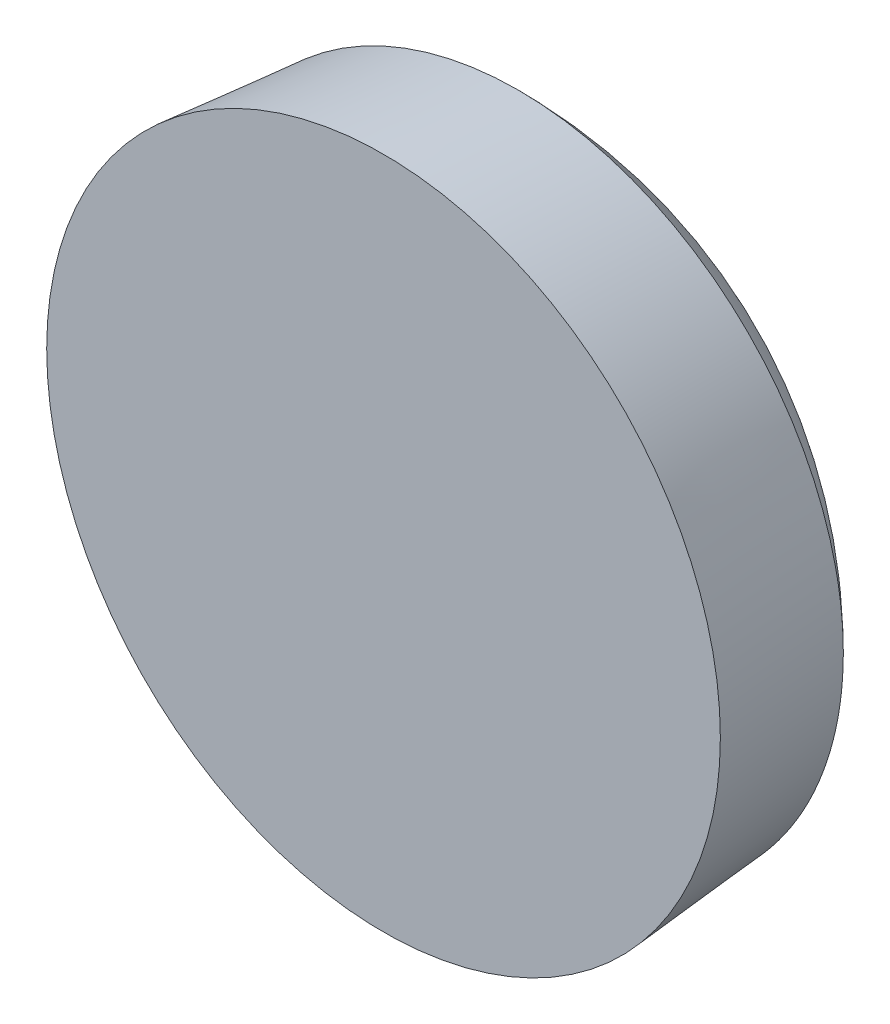
ISO-10303-21;
HEADER;
FILE_DESCRIPTION(('STEP AP214'),'2;1');
FILE_NAME('part.step','',(''),(''),'','','');
FILE_SCHEMA(('AUTOMOTIVE_DESIGN { 1 0 10303 214 1 1 1 1 }'));
ENDSEC;
DATA;
#1=APPLICATION_CONTEXT('core data for automotive mechanical design processes');
#2=APPLICATION_PROTOCOL_DEFINITION('international standard','automotive_design',2000,#1);
#3=PRODUCT_CONTEXT('',#1,'mechanical');
#4=PRODUCT('Part','Part','',(#3));
#5=PRODUCT_RELATED_PRODUCT_CATEGORY('part','',(#4));
#6=PRODUCT_DEFINITION_FORMATION('','',#4);
#7=PRODUCT_DEFINITION_CONTEXT('part definition',#1,'design');
#8=PRODUCT_DEFINITION('design','',#6,#7);
#9=PRODUCT_DEFINITION_SHAPE('','',#8);
#10=(LENGTH_UNIT() NAMED_UNIT(*) SI_UNIT(.MILLI.,.METRE.));
#11=(NAMED_UNIT(*) PLANE_ANGLE_UNIT() SI_UNIT($,.RADIAN.));
#12=(NAMED_UNIT(*) SI_UNIT($,.STERADIAN.) SOLID_ANGLE_UNIT());
#13=UNCERTAINTY_MEASURE_WITH_UNIT(LENGTH_MEASURE(1.E-05),#10,'distance_accuracy_value','');
#14=(GEOMETRIC_REPRESENTATION_CONTEXT(3) GLOBAL_UNCERTAINTY_ASSIGNED_CONTEXT((#13)) GLOBAL_UNIT_ASSIGNED_CONTEXT((#10,
#11,#12)) REPRESENTATION_CONTEXT('',''));
#15=CARTESIAN_POINT('',(0.,0.,0.));
#16=DIRECTION('',(0.,0.,1.));
#17=DIRECTION('',(1.,0.,0.));
#18=AXIS2_PLACEMENT_3D('',#15,#16,#17);
#19=CARTESIAN_POINT('',(6.90000000000015,4.50499199787339,-21.6));
#20=DIRECTION('',(0.,0.,-1.));
#21=DIRECTION('',(0.,1.,0.));
#22=AXIS2_PLACEMENT_3D('',#19,#20,#21);
#23=PLANE('',#22);
#24=DIRECTION('',(0.747876143588401,-0.66383828893138,0.));
#25=VECTOR('',#24,1.);
#26=CARTESIAN_POINT('',(7.0194908920078,4.6396097037193,-21.6));
#27=LINE('',#26,#25);
#28=CARTESIAN_POINT('',(6.88487318616189,4.75910059572695,-21.6));
#29=VERTEX_POINT('',#28);
#30=CARTESIAN_POINT('',(6.30900855559882,5.27025607820411,-21.6));
#31=VERTEX_POINT('',#30);
#32=EDGE_CURVE('E84',#29,#31,#27,.F.);
#33=ORIENTED_EDGE('',*,*,#32,.F.);
#34=DIRECTION('',(0.66383828893138,0.747876143588401,0.));
#35=VECTOR('',#34,1.);
#36=CARTESIAN_POINT('',(6.76538229415424,4.62448288988104,-21.6));
#37=LINE('',#36,#35);
#38=CARTESIAN_POINT('',(7.39602866863905,5.33496522629002,-21.6));
#39=VERTEX_POINT('',#38);
#40=EDGE_CURVE('E89',#39,#29,#37,.F.);
#41=ORIENTED_EDGE('',*,*,#40,.F.);
#42=DIRECTION('',(0.747876143588401,-0.66383828893138,0.));
#43=VECTOR('',#42,1.);
#44=CARTESIAN_POINT('',(7.53064637448496,5.21547433428237,-21.6));
#45=LINE('',#44,#43);
#46=CARTESIAN_POINT('',(7.66526408033088,5.09598344227472,-21.6));
#47=VERTEX_POINT('',#46);
#48=EDGE_CURVE('E140',#47,#39,#45,.F.);
#49=ORIENTED_EDGE('',*,*,#48,.F.);
#50=DIRECTION('',(-0.66383828893138,-0.747876143588401,0.));
#51=VECTOR('',#50,1.);
#52=CARTESIAN_POINT('',(7.03461770584607,4.38550110586574,-21.6));
#53=LINE('',#52,#51);
#54=CARTESIAN_POINT('',(7.15410859785371,4.52011881171165,-21.6));
#55=VERTEX_POINT('',#54);
#56=EDGE_CURVE('E151',#55,#47,#53,.F.);
#57=ORIENTED_EDGE('',*,*,#56,.F.);
#58=DIRECTION('',(0.747876143588401,-0.66383828893138,0.));
#59=VECTOR('',#58,1.);
#60=CARTESIAN_POINT('',(7.0194908920078,4.6396097037193,-21.6));
#61=LINE('',#60,#59);
#62=CARTESIAN_POINT('',(7.72997322841678,4.0089633292345,-21.6));
#63=VERTEX_POINT('',#62);
#64=EDGE_CURVE('E154',#63,#55,#61,.F.);
#65=ORIENTED_EDGE('',*,*,#64,.F.);
#66=DIRECTION('',(-0.66383828893138,-0.747876143588401,0.));
#67=VECTOR('',#66,1.);
#68=CARTESIAN_POINT('',(7.61048233640913,3.87434562338858,-21.6));
#69=LINE('',#68,#67);
#70=CARTESIAN_POINT('',(7.49099144440148,3.73972791754266,-21.6));
#71=VERTEX_POINT('',#70);
#72=EDGE_CURVE('E162',#71,#63,#69,.F.);
#73=ORIENTED_EDGE('',*,*,#72,.F.);
#74=DIRECTION('',(-0.747876143588401,0.66383828893138,0.));
#75=VECTOR('',#74,1.);
#76=CARTESIAN_POINT('',(6.7805091079925,4.37037429202747,-21.6));
#77=LINE('',#76,#75);
#78=CARTESIAN_POINT('',(6.91512681383842,4.25088340001982,-21.6));
#79=VERTEX_POINT('',#78);
#80=EDGE_CURVE('E167',#79,#71,#77,.F.);
#81=ORIENTED_EDGE('',*,*,#80,.F.);
#82=DIRECTION('',(-0.66383828893138,-0.747876143588401,0.));
#83=VECTOR('',#82,1.);
#84=CARTESIAN_POINT('',(7.03461770584607,4.38550110586574,-21.6));
#85=LINE('',#84,#83);
#86=CARTESIAN_POINT('',(6.40397133136126,3.67501876945676,-21.6));
#87=VERTEX_POINT('',#86);
#88=EDGE_CURVE('E172',#87,#79,#85,.F.);
#89=ORIENTED_EDGE('',*,*,#88,.F.);
#90=DIRECTION('',(0.747876143588401,-0.66383828893138,0.));
#91=VECTOR('',#90,1.);
#92=CARTESIAN_POINT('',(6.26935362551534,3.79450966146441,-21.6));
#93=LINE('',#92,#91);
#94=CARTESIAN_POINT('',(6.13473591966943,3.91400055347206,-21.6));
#95=VERTEX_POINT('',#94);
#96=EDGE_CURVE('E178',#87,#95,#93,.F.);
#97=ORIENTED_EDGE('',*,*,#96,.T.);
#98=DIRECTION('',(0.66383828893138,0.747876143588401,0.));
#99=VECTOR('',#98,1.);
#100=CARTESIAN_POINT('',(6.76538229415424,4.62448288988104,-21.6));
#101=LINE('',#100,#99);
#102=CARTESIAN_POINT('',(6.64589140214659,4.48986518403512,-21.6));
#103=VERTEX_POINT('',#102);
#104=EDGE_CURVE('E183',#103,#95,#101,.F.);
#105=ORIENTED_EDGE('',*,*,#104,.F.);
#106=DIRECTION('',(-0.747876143588401,0.66383828893138,0.));
#107=VECTOR('',#106,1.);
#108=CARTESIAN_POINT('',(6.7805091079925,4.37037429202747,-21.6));
#109=LINE('',#108,#107);
#110=CARTESIAN_POINT('',(6.07002677158352,5.00102066651228,-21.6));
#111=VERTEX_POINT('',#110);
#112=EDGE_CURVE('E119',#111,#103,#109,.F.);
#113=ORIENTED_EDGE('',*,*,#112,.F.);
#114=DIRECTION('',(-0.66383828893138,-0.747876143588401,0.));
#115=VECTOR('',#114,1.);
#116=CARTESIAN_POINT('',(6.18951766359117,5.1356383723582,-21.6));
#117=LINE('',#116,#115);
#118=EDGE_CURVE('E117',#111,#31,#117,.F.);
#119=ORIENTED_EDGE('',*,*,#118,.T.);
#120=EDGE_LOOP('',(#33,#41,#49,#57,#65,#73,#81,#89,#97,#105,#113,#119));
#121=FACE_BOUND('',#120,.T.);
#122=ADVANCED_FACE('F17',(#121),#23,.T.);
#123=CARTESIAN_POINT('',(7.0194908920078,4.6396097037193,-22.2));
#124=DIRECTION('',(-0.66383828893138,-0.747876143588401,0.));
#125=DIRECTION('',(0.747876143588401,-0.66383828893138,0.));
#126=AXIS2_PLACEMENT_3D('',#123,#124,#125);
#127=PLANE('',#126);
#128=DIRECTION('',(0.,0.,1.));
#129=VECTOR('',#128,1.);
#130=CARTESIAN_POINT('',(6.88487318616189,4.75910059572695,-22.2));
#131=LINE('',#130,#129);
#132=CARTESIAN_POINT('',(6.88487318616188,4.75910059572695,-22.788097569794));
#133=VERTEX_POINT('',#132);
#134=EDGE_CURVE('E127',#29,#133,#131,.F.);
#135=ORIENTED_EDGE('',*,*,#134,.F.);
#136=ORIENTED_EDGE('',*,*,#32,.T.);
#137=DIRECTION('',(0.,0.,1.));
#138=VECTOR('',#137,1.);
#139=CARTESIAN_POINT('',(6.30900855559882,5.27025607820411,-22.2));
#140=LINE('',#139,#138);
#141=CARTESIAN_POINT('',(6.30900855559882,5.27025607820411,-22.6229045231911));
#142=VERTEX_POINT('',#141);
#143=EDGE_CURVE('E123',#31,#142,#140,.F.);
#144=ORIENTED_EDGE('',*,*,#143,.T.);
#145=CARTESIAN_POINT('',(6.88487318616188,4.75910059572695,-22.788097569794));
#146=CARTESIAN_POINT('',(6.86018725238199,4.78101260372668,-22.7859104299673));
#147=CARTESIAN_POINT('',(6.83553118762501,4.80289809904617,-22.7831210421487));
#148=CARTESIAN_POINT('',(6.78640820570417,4.84650119635726,-22.7763560552392));
#149=CARTESIAN_POINT('',(6.76194092600565,4.868219120146,-22.7723851623111));
#150=CARTESIAN_POINT('',(6.71319426733734,4.91148818115152,-22.7632701136372));
#151=CARTESIAN_POINT('',(6.68891456403111,4.93303960625947,-22.7581290588921));
#152=CARTESIAN_POINT('',(6.64054218782471,4.97597644242906,-22.7466823115268));
#153=CARTESIAN_POINT('',(6.61644931068595,4.99736203477927,-22.7403781619621));
#154=CARTESIAN_POINT('',(6.56844981562365,5.03996788996653,-22.7266089835755));
#155=CARTESIAN_POINT('',(6.5445431977001,5.06118815280357,-22.7191439547536));
#156=CARTESIAN_POINT('',(6.4969160965814,5.10346345946291,-22.703052205587));
#157=CARTESIAN_POINT('',(6.47319590048995,5.12451824844295,-22.6944239659575));
#158=CARTESIAN_POINT('',(6.42594275839351,5.16646161736154,-22.6760004253173));
#159=CARTESIAN_POINT('',(6.40241046789993,5.18734961544761,-22.666202118307));
#160=CARTESIAN_POINT('',(6.35553505693748,5.22895769838091,-22.6454289197685));
#161=CARTESIAN_POINT('',(6.332193049565,5.24967679520893,-22.6344495373844));
#162=CARTESIAN_POINT('',(6.30900855559883,5.2702560782041,-22.6229045231911));
#163=B_SPLINE_CURVE_WITH_KNOTS('',3,(#145,#146,#147,#148,#149,#150,#151,#152,#153,#154,#155,
#156,#157,#158,#159,#160,#161,#162),.UNSPECIFIED.,.F.,.F.,(4,2,2,2,2,2,2,2,4),(0.,
0.0992357442434151,0.198081387639265,0.296668072480489,0.395124892694087,0.493581712907686,
0.59216839774891,0.69101404114476,0.790249785388174),.UNSPECIFIED.);
#164=EDGE_CURVE('E20',#133,#142,#163,.T.);
#165=ORIENTED_EDGE('',*,*,#164,.F.);
#166=EDGE_LOOP('',(#135,#136,#144,#165));
#167=FACE_BOUND('',#166,.T.);
#168=ADVANCED_FACE('F125',(#167),#127,.T.);
#169=CARTESIAN_POINT('',(6.18951766359117,5.1356383723582,-22.2));
#170=DIRECTION('',(-0.747876143588401,0.66383828893138,0.));
#171=DIRECTION('',(-0.66383828893138,-0.747876143588401,0.));
#172=AXIS2_PLACEMENT_3D('',#169,#170,#171);
#173=PLANE('',#172);
#174=ORIENTED_EDGE('',*,*,#118,.F.);
#175=DIRECTION('',(0.,0.,1.));
#176=VECTOR('',#175,1.);
#177=CARTESIAN_POINT('',(6.07002677158352,5.00102066651228,-22.2));
#178=LINE('',#177,#176);
#179=CARTESIAN_POINT('',(6.07002677158353,5.00102066651227,-22.6229045231911));
#180=VERTEX_POINT('',#179);
#181=EDGE_CURVE('E132',#180,#111,#178,.T.);
#182=ORIENTED_EDGE('',*,*,#181,.F.);
#183=CARTESIAN_POINT('',(6.30900855559881,5.27025607820411,-22.622904523191));
#184=CARTESIAN_POINT('',(6.26917825826292,5.22538350958884,-22.6271329188894));
#185=CARTESIAN_POINT('',(6.22934796092705,5.18051094097354,-22.6292471167385));
#186=CARTESIAN_POINT('',(6.14968736625534,5.09076580374292,-22.6292471167386));
#187=CARTESIAN_POINT('',(6.10985706891951,5.04589323512759,-22.6271329188894));
#188=CARTESIAN_POINT('',(6.0700267715837,5.00102066651224,-22.6229045231911));
#189=B_SPLINE_CURVE_WITH_KNOTS('',3,(#183,#184,#185,#186,#187,#188),.UNSPECIFIED.,.F.,.F.,(4,2,
4),(0.,0.180111711148645,0.360223422297292),.UNSPECIFIED.);
#190=EDGE_CURVE('E131',#142,#180,#189,.T.);
#191=ORIENTED_EDGE('',*,*,#190,.F.);
#192=ORIENTED_EDGE('',*,*,#143,.F.);
#193=EDGE_LOOP('',(#174,#182,#191,#192));
#194=FACE_BOUND('',#193,.T.);
#195=ADVANCED_FACE('F129',(#194),#173,.F.);
#196=CARTESIAN_POINT('',(6.7805091079925,4.37037429202747,-22.2));
#197=DIRECTION('',(0.66383828893138,0.747876143588401,0.));
#198=DIRECTION('',(-0.747876143588401,0.66383828893138,0.));
#199=AXIS2_PLACEMENT_3D('',#196,#197,#198);
#200=PLANE('',#199);
#201=DIRECTION('',(0.,0.,1.));
#202=VECTOR('',#201,1.);
#203=CARTESIAN_POINT('',(6.64589140214659,4.48986518403512,-22.2));
#204=LINE('',#203,#202);
#205=CARTESIAN_POINT('',(6.64589140214659,4.48986518403512,-22.788097569794));
#206=VERTEX_POINT('',#205);
#207=EDGE_CURVE('E180',#206,#103,#204,.T.);
#208=ORIENTED_EDGE('',*,*,#207,.F.);
#209=CARTESIAN_POINT('',(6.07002677158353,5.00102066651226,-22.6229045231911));
#210=CARTESIAN_POINT('',(6.0932112655497,4.98044138351709,-22.6344495373844));
#211=CARTESIAN_POINT('',(6.11655327292218,4.95972228668908,-22.6454289197685));
#212=CARTESIAN_POINT('',(6.16342868388463,4.91811420375577,-22.666202118307));
#213=CARTESIAN_POINT('',(6.18696097437821,4.89722620566971,-22.6760004253173));
#214=CARTESIAN_POINT('',(6.23421411647465,4.85528283675112,-22.6944239659575));
#215=CARTESIAN_POINT('',(6.2579343125661,4.83422804777108,-22.703052205587));
#216=CARTESIAN_POINT('',(6.30556141368481,4.79195274111174,-22.7191439547536));
#217=CARTESIAN_POINT('',(6.32946803160835,4.77073247827469,-22.7266089835755));
#218=CARTESIAN_POINT('',(6.37746752667065,4.72812662308744,-22.7403781619621));
#219=CARTESIAN_POINT('',(6.40156040380941,4.70674103073723,-22.7466823115268));
#220=CARTESIAN_POINT('',(6.44993278001582,4.66380419456763,-22.7581290588921));
#221=CARTESIAN_POINT('',(6.47421248332204,4.64225276945969,-22.7632701136372));
#222=CARTESIAN_POINT('',(6.52295914199035,4.59898370845417,-22.7723851623111));
#223=CARTESIAN_POINT('',(6.54742642168887,4.57726578466543,-22.7763560552392));
#224=CARTESIAN_POINT('',(6.59654940360971,4.53366268735433,-22.7831210421487));
#225=CARTESIAN_POINT('',(6.62120546836669,4.51177719203485,-22.7859104299673));
#226=CARTESIAN_POINT('',(6.64589140214659,4.48986518403512,-22.788097569794));
#227=B_SPLINE_CURVE_WITH_KNOTS('',3,(#209,#210,#211,#212,#213,#214,#215,#216,#217,#218,#219,
#220,#221,#222,#223,#224,#225,#226),.UNSPECIFIED.,.F.,.F.,(4,2,2,2,2,2,2,2,4),(0.,
0.0992357442434142,0.198081387639266,0.29666807248049,0.395124892694088,0.493581712907686,
0.592168397748911,0.69101404114476,0.790249785388176),.UNSPECIFIED.);
#228=EDGE_CURVE('E296',#180,#206,#227,.T.);
#229=ORIENTED_EDGE('',*,*,#228,.F.);
#230=ORIENTED_EDGE('',*,*,#181,.T.);
#231=ORIENTED_EDGE('',*,*,#112,.T.);
#232=EDGE_LOOP('',(#208,#229,#230,#231));
#233=FACE_BOUND('',#232,.T.);
#234=ADVANCED_FACE('F305',(#233),#200,.T.);
#235=CARTESIAN_POINT('',(6.76538229415424,4.62448288988104,-22.2));
#236=DIRECTION('',(0.747876143588401,-0.66383828893138,0.));
#237=DIRECTION('',(0.66383828893138,0.747876143588401,0.));
#238=AXIS2_PLACEMENT_3D('',#235,#236,#237);
#239=PLANE('',#238);
#240=CARTESIAN_POINT('',(6.64589140214659,4.48986518403512,-22.788097569794));
#241=CARTESIAN_POINT('',(6.62397939414685,4.46517925025523,-22.7859104299673));
#242=CARTESIAN_POINT('',(6.60209389882737,4.44052318549824,-22.7831210421487));
#243=CARTESIAN_POINT('',(6.55849080151627,4.39140020357741,-22.7763560552392));
#244=CARTESIAN_POINT('',(6.53677287772753,4.36693292387889,-22.7723851623111));
#245=CARTESIAN_POINT('',(6.49350381672202,4.31818626521058,-22.7632701136372));
#246=CARTESIAN_POINT('',(6.47195239161407,4.29390656190435,-22.7581290588921));
#247=CARTESIAN_POINT('',(6.42901555544448,4.24553418569795,-22.7466823115268));
#248=CARTESIAN_POINT('',(6.40762996309427,4.22144130855919,-22.7403781619621));
#249=CARTESIAN_POINT('',(6.36502410790701,4.17344181349689,-22.7266089835755));
#250=CARTESIAN_POINT('',(6.34380384506997,4.14953519557334,-22.7191439547536));
#251=CARTESIAN_POINT('',(6.30152853841063,4.10190809445464,-22.703052205587));
#252=CARTESIAN_POINT('',(6.28047374943058,4.07818789836319,-22.6944239659575));
#253=CARTESIAN_POINT('',(6.238530380512,4.03093475626675,-22.6760004253173));
#254=CARTESIAN_POINT('',(6.21764238242593,4.00740246577317,-22.666202118307));
#255=CARTESIAN_POINT('',(6.17603429949263,3.96052705481072,-22.6454289197685));
#256=CARTESIAN_POINT('',(6.15531520266461,3.93718504743825,-22.6344495373844));
#257=CARTESIAN_POINT('',(6.13473591966944,3.91400055347207,-22.6229045231911));
#258=B_SPLINE_CURVE_WITH_KNOTS('',3,(#240,#241,#242,#243,#244,#245,#246,#247,#248,#249,#250,
#251,#252,#253,#254,#255,#256,#257),.UNSPECIFIED.,.F.,.F.,(4,2,2,2,2,2,2,2,4),(0.,
0.0992357442434148,0.198081387639264,0.296668072480486,0.395124892694084,0.493581712907682,
0.592168397748906,0.691014041144754,0.790249785388168),.UNSPECIFIED.);
#259=CARTESIAN_POINT('',(6.13473591966943,3.91400055347206,-22.6229045231911));
#260=VERTEX_POINT('',#259);
#261=EDGE_CURVE('E289',#206,#260,#258,.T.);
#262=ORIENTED_EDGE('',*,*,#261,.F.);
#263=ORIENTED_EDGE('',*,*,#207,.T.);
#264=ORIENTED_EDGE('',*,*,#104,.T.);
#265=DIRECTION('',(0.,0.,1.));
#266=VECTOR('',#265,1.);
#267=CARTESIAN_POINT('',(6.13473591966943,3.91400055347206,-22.2));
#268=LINE('',#267,#266);
#269=EDGE_CURVE('E175',#95,#260,#268,.F.);
#270=ORIENTED_EDGE('',*,*,#269,.T.);
#271=EDGE_LOOP('',(#262,#263,#264,#270));
#272=FACE_BOUND('',#271,.T.);
#273=ADVANCED_FACE('F302',(#272),#239,.T.);
#274=CARTESIAN_POINT('',(6.26935362551534,3.79450966146441,-22.2));
#275=DIRECTION('',(-0.66383828893138,-0.747876143588401,0.));
#276=DIRECTION('',(0.747876143588401,-0.66383828893138,0.));
#277=AXIS2_PLACEMENT_3D('',#274,#275,#276);
#278=PLANE('',#277);
#279=ORIENTED_EDGE('',*,*,#96,.F.);
#280=DIRECTION('',(0.,0.,1.));
#281=VECTOR('',#280,1.);
#282=CARTESIAN_POINT('',(6.40397133136126,3.67501876945675,-22.2));
#283=LINE('',#282,#281);
#284=CARTESIAN_POINT('',(6.40397133136126,3.67501876945676,-22.6229045231911));
#285=VERTEX_POINT('',#284);
#286=EDGE_CURVE('E174',#285,#87,#283,.T.);
#287=ORIENTED_EDGE('',*,*,#286,.F.);
#288=CARTESIAN_POINT('',(6.13473591966943,3.91400055347206,-22.622904523191));
#289=CARTESIAN_POINT('',(6.17960848828474,3.87417025613617,-22.6271329188894));
#290=CARTESIAN_POINT('',(6.22448105690004,3.83433995880029,-22.6292471167385));
#291=CARTESIAN_POINT('',(6.31422619413064,3.75467936412853,-22.6292471167385));
#292=CARTESIAN_POINT('',(6.35909876274595,3.71484906679265,-22.6271329188894));
#293=CARTESIAN_POINT('',(6.40397133136125,3.67501876945676,-22.622904523191));
#294=B_SPLINE_CURVE_WITH_KNOTS('',3,(#288,#289,#290,#291,#292,#293),.UNSPECIFIED.,.F.,.F.,(4,2,
4),(0.,0.180111711148684,0.360223422297368),.UNSPECIFIED.);
#295=EDGE_CURVE('E282',#260,#285,#294,.T.);
#296=ORIENTED_EDGE('',*,*,#295,.F.);
#297=ORIENTED_EDGE('',*,*,#269,.F.);
#298=EDGE_LOOP('',(#279,#287,#296,#297));
#299=FACE_BOUND('',#298,.T.);
#300=ADVANCED_FACE('F271',(#299),#278,.F.);
#301=CARTESIAN_POINT('',(7.03461770584607,4.38550110586574,-22.2));
#302=DIRECTION('',(-0.747876143588401,0.66383828893138,0.));
#303=DIRECTION('',(-0.66383828893138,-0.747876143588401,0.));
#304=AXIS2_PLACEMENT_3D('',#301,#302,#303);
#305=PLANE('',#304);
#306=CARTESIAN_POINT('',(6.40397133136127,3.67501876945677,-22.622904523191));
#307=CARTESIAN_POINT('',(6.42455061435644,3.69820326342294,-22.6344495373844));
#308=CARTESIAN_POINT('',(6.44526971118445,3.72154527079542,-22.6454289197685));
#309=CARTESIAN_POINT('',(6.48687779411776,3.76842068175787,-22.666202118307));
#310=CARTESIAN_POINT('',(6.50776579220383,3.79195297225144,-22.6760004253173));
#311=CARTESIAN_POINT('',(6.54970916112241,3.83920611434789,-22.6944239659575));
#312=CARTESIAN_POINT('',(6.57076395010246,3.86292631043934,-22.703052205587));
#313=CARTESIAN_POINT('',(6.6130392567618,3.91055341155804,-22.7191439547536));
#314=CARTESIAN_POINT('',(6.63425951959884,3.93446002948158,-22.7266089835755));
#315=CARTESIAN_POINT('',(6.67686537478609,3.98245952454389,-22.7403781619621));
#316=CARTESIAN_POINT('',(6.6982509671363,4.00655240168265,-22.7466823115268));
#317=CARTESIAN_POINT('',(6.7411878033059,4.05492477788905,-22.7581290588921));
#318=CARTESIAN_POINT('',(6.76273922841385,4.07920448119528,-22.7632701136372));
#319=CARTESIAN_POINT('',(6.80600828941936,4.12795113986359,-22.7723851623111));
#320=CARTESIAN_POINT('',(6.8277262132081,4.15241841956211,-22.7763560552392));
#321=CARTESIAN_POINT('',(6.8713293105192,4.20154140148294,-22.7831210421487));
#322=CARTESIAN_POINT('',(6.89321480583868,4.22619746623993,-22.7859104299673));
#323=CARTESIAN_POINT('',(6.91512681383842,4.25088340001982,-22.788097569794));
#324=B_SPLINE_CURVE_WITH_KNOTS('',3,(#306,#307,#308,#309,#310,#311,#312,#313,#314,#315,#316,
#317,#318,#319,#320,#321,#322,#323),.UNSPECIFIED.,.F.,.F.,(4,2,2,2,2,2,2,2,4),(0.,
0.0992357442434163,0.198081387639265,0.29666807248049,0.395124892694089,0.493581712907688,
0.592168397748912,0.69101404114476,0.790249785388177),.UNSPECIFIED.);
#325=CARTESIAN_POINT('',(6.91512681383842,4.25088340001981,-22.788097569794));
#326=VERTEX_POINT('',#325);
#327=EDGE_CURVE('E275',#285,#326,#324,.T.);
#328=ORIENTED_EDGE('',*,*,#327,.F.);
#329=ORIENTED_EDGE('',*,*,#286,.T.);
#330=ORIENTED_EDGE('',*,*,#88,.T.);
#331=DIRECTION('',(0.,0.,1.));
#332=VECTOR('',#331,1.);
#333=CARTESIAN_POINT('',(6.91512681383842,4.25088340001982,-22.2));
#334=LINE('',#333,#332);
#335=EDGE_CURVE('E169',#326,#79,#334,.T.);
#336=ORIENTED_EDGE('',*,*,#335,.F.);
#337=EDGE_LOOP('',(#328,#329,#330,#336));
#338=FACE_BOUND('',#337,.T.);
#339=ADVANCED_FACE('F266',(#338),#305,.T.);
#340=CARTESIAN_POINT('',(6.7805091079925,4.37037429202747,-22.2));
#341=DIRECTION('',(0.66383828893138,0.747876143588401,0.));
#342=DIRECTION('',(-0.747876143588401,0.66383828893138,0.));
#343=AXIS2_PLACEMENT_3D('',#340,#341,#342);
#344=PLANE('',#343);
#345=ORIENTED_EDGE('',*,*,#335,.T.);
#346=ORIENTED_EDGE('',*,*,#80,.T.);
#347=DIRECTION('',(0.,0.,1.));
#348=VECTOR('',#347,1.);
#349=CARTESIAN_POINT('',(7.49099144440148,3.73972791754266,-22.2));
#350=LINE('',#349,#348);
#351=CARTESIAN_POINT('',(7.49099144440148,3.73972791754266,-22.6229045231911));
#352=VERTEX_POINT('',#351);
#353=EDGE_CURVE('E164',#352,#71,#350,.T.);
#354=ORIENTED_EDGE('',*,*,#353,.F.);
#355=CARTESIAN_POINT('',(6.91512681383841,4.25088340001981,-22.788097569794));
#356=CARTESIAN_POINT('',(6.93981274761831,4.22897139202008,-22.7859104299673));
#357=CARTESIAN_POINT('',(6.96446881237529,4.2070858967006,-22.7831210421487));
#358=CARTESIAN_POINT('',(7.01359179429613,4.1634827993895,-22.7763560552392));
#359=CARTESIAN_POINT('',(7.03805907399465,4.14176487560076,-22.7723851623111));
#360=CARTESIAN_POINT('',(7.08680573266296,4.09849581459525,-22.7632701136372));
#361=CARTESIAN_POINT('',(7.11108543596918,4.0769443894873,-22.7581290588921));
#362=CARTESIAN_POINT('',(7.15945781217559,4.03400755331771,-22.7466823115268));
#363=CARTESIAN_POINT('',(7.18355068931435,4.0126219609675,-22.7403781619621));
#364=CARTESIAN_POINT('',(7.23155018437665,3.97001610578024,-22.7266089835755));
#365=CARTESIAN_POINT('',(7.25545680230019,3.9487958429432,-22.7191439547536));
#366=CARTESIAN_POINT('',(7.3030839034189,3.90652053628386,-22.703052205587));
#367=CARTESIAN_POINT('',(7.32680409951034,3.88546574730382,-22.6944239659575));
#368=CARTESIAN_POINT('',(7.37405724160679,3.84352237838523,-22.6760004253173));
#369=CARTESIAN_POINT('',(7.39758953210036,3.82263438029916,-22.666202118307));
#370=CARTESIAN_POINT('',(7.44446494306281,3.78102629736586,-22.6454289197685));
#371=CARTESIAN_POINT('',(7.46780695043529,3.76030720053785,-22.6344495373844));
#372=CARTESIAN_POINT('',(7.49099144440146,3.73972791754267,-22.622904523191));
#373=B_SPLINE_CURVE_WITH_KNOTS('',3,(#355,#356,#357,#358,#359,#360,#361,#362,#363,#364,#365,
#366,#367,#368,#369,#370,#371,#372),.UNSPECIFIED.,.F.,.F.,(4,2,2,2,2,2,2,2,4),(0.,
0.099235744243415,0.198081387639264,0.296668072480487,0.395124892694085,0.493581712907683,
0.592168397748905,0.691014041144756,0.79024978538817),.UNSPECIFIED.);
#374=EDGE_CURVE('E251',#326,#352,#373,.T.);
#375=ORIENTED_EDGE('',*,*,#374,.F.);
#376=EDGE_LOOP('',(#345,#346,#354,#375));
#377=FACE_BOUND('',#376,.T.);
#378=ADVANCED_FACE('F261',(#377),#344,.T.);
#379=CARTESIAN_POINT('',(7.61048233640913,3.87434562338858,-22.2));
#380=DIRECTION('',(-0.747876143588401,0.66383828893138,0.));
#381=DIRECTION('',(-0.66383828893138,-0.747876143588401,0.));
#382=AXIS2_PLACEMENT_3D('',#379,#380,#381);
#383=PLANE('',#382);
#384=ORIENTED_EDGE('',*,*,#353,.T.);
#385=ORIENTED_EDGE('',*,*,#72,.T.);
#386=DIRECTION('',(0.,0.,1.));
#387=VECTOR('',#386,1.);
#388=CARTESIAN_POINT('',(7.72997322841677,4.0089633292345,-22.2));
#389=LINE('',#388,#387);
#390=CARTESIAN_POINT('',(7.72997322841677,4.0089633292345,-22.6229045231911));
#391=VERTEX_POINT('',#390);
#392=EDGE_CURVE('E159',#391,#63,#389,.T.);
#393=ORIENTED_EDGE('',*,*,#392,.F.);
#394=CARTESIAN_POINT('',(7.49099144440148,3.73972791754267,-22.622904523191));
#395=CARTESIAN_POINT('',(7.53082174173736,3.78460048615797,-22.6271329188894));
#396=CARTESIAN_POINT('',(7.57065203907325,3.82947305477328,-22.6292471167385));
#397=CARTESIAN_POINT('',(7.65031263374501,3.91921819200389,-22.6292471167385));
#398=CARTESIAN_POINT('',(7.6901429310809,3.96409076061919,-22.6271329188894));
#399=CARTESIAN_POINT('',(7.72997322841678,4.0089633292345,-22.622904523191));
#400=B_SPLINE_CURVE_WITH_KNOTS('',3,(#394,#395,#396,#397,#398,#399),.UNSPECIFIED.,.F.,.F.,(4,2,
4),(0.,0.180111711148692,0.360223422297385),.UNSPECIFIED.);
#401=EDGE_CURVE('E244',#352,#391,#400,.T.);
#402=ORIENTED_EDGE('',*,*,#401,.F.);
#403=EDGE_LOOP('',(#384,#385,#393,#402));
#404=FACE_BOUND('',#403,.T.);
#405=ADVANCED_FACE('F258',(#404),#383,.T.);
#406=CARTESIAN_POINT('',(7.0194908920078,4.6396097037193,-22.2));
#407=DIRECTION('',(-0.66383828893138,-0.747876143588401,0.));
#408=DIRECTION('',(0.747876143588401,-0.66383828893138,0.));
#409=AXIS2_PLACEMENT_3D('',#406,#407,#408);
#410=PLANE('',#409);
#411=DIRECTION('',(0.,0.,1.));
#412=VECTOR('',#411,1.);
#413=CARTESIAN_POINT('',(7.15410859785371,4.52011881171165,-22.2));
#414=LINE('',#413,#412);
#415=CARTESIAN_POINT('',(7.15410859785371,4.52011881171165,-22.788097569794));
#416=VERTEX_POINT('',#415);
#417=EDGE_CURVE('E143',#416,#55,#414,.T.);
#418=ORIENTED_EDGE('',*,*,#417,.F.);
#419=CARTESIAN_POINT('',(7.72997322841676,4.00896332923451,-22.6229045231911));
#420=CARTESIAN_POINT('',(7.70678873445059,4.02954261222968,-22.6344495373844));
#421=CARTESIAN_POINT('',(7.68344672707811,4.05026170905769,-22.6454289197685));
#422=CARTESIAN_POINT('',(7.63657131611566,4.091869791991,-22.666202118307));
#423=CARTESIAN_POINT('',(7.61303902562209,4.11275779007707,-22.6760004253173));
#424=CARTESIAN_POINT('',(7.56578588352564,4.15470115899565,-22.6944239659575));
#425=CARTESIAN_POINT('',(7.54206568743419,4.17575594797569,-22.703052205587));
#426=CARTESIAN_POINT('',(7.49443858631549,4.21803125463503,-22.7191439547536));
#427=CARTESIAN_POINT('',(7.47053196839195,4.23925151747208,-22.7266089835755));
#428=CARTESIAN_POINT('',(7.42253247332964,4.28185737265933,-22.7403781619621));
#429=CARTESIAN_POINT('',(7.39843959619088,4.30324296500954,-22.7466823115268));
#430=CARTESIAN_POINT('',(7.35006721998448,4.34617980117913,-22.7581290588921));
#431=CARTESIAN_POINT('',(7.32578751667826,4.36773122628708,-22.7632701136372));
#432=CARTESIAN_POINT('',(7.27704085800994,4.41100028729259,-22.7723851623111));
#433=CARTESIAN_POINT('',(7.25257357831142,4.43271821108134,-22.7763560552392));
#434=CARTESIAN_POINT('',(7.20345059639059,4.47632130839243,-22.7831210421487));
#435=CARTESIAN_POINT('',(7.17879453163361,4.49820680371192,-22.7859104299673));
#436=CARTESIAN_POINT('',(7.15410859785371,4.52011881171165,-22.788097569794));
#437=B_SPLINE_CURVE_WITH_KNOTS('',3,(#419,#420,#421,#422,#423,#424,#425,#426,#427,#428,#429,
#430,#431,#432,#433,#434,#435,#436),.UNSPECIFIED.,.F.,.F.,(4,2,2,2,2,2,2,2,4),(0.,
0.099235744243414,0.198081387639263,0.296668072480486,0.395124892694084,0.493581712907682,
0.592168397748905,0.691014041144755,0.79024978538817),.UNSPECIFIED.);
#438=EDGE_CURVE('E237',#391,#416,#437,.T.);
#439=ORIENTED_EDGE('',*,*,#438,.F.);
#440=ORIENTED_EDGE('',*,*,#392,.T.);
#441=ORIENTED_EDGE('',*,*,#64,.T.);
#442=EDGE_LOOP('',(#418,#439,#440,#441));
#443=FACE_BOUND('',#442,.T.);
#444=ADVANCED_FACE('F226',(#443),#410,.T.);
#445=CARTESIAN_POINT('',(7.03461770584607,4.38550110586574,-22.2));
#446=DIRECTION('',(-0.747876143588401,0.66383828893138,0.));
#447=DIRECTION('',(-0.66383828893138,-0.747876143588401,0.));
#448=AXIS2_PLACEMENT_3D('',#445,#446,#447);
#449=PLANE('',#448);
#450=CARTESIAN_POINT('',(7.15410859785371,4.52011881171165,-22.788097569794));
#451=CARTESIAN_POINT('',(7.17602060585345,4.54480474549154,-22.7859104299673));
#452=CARTESIAN_POINT('',(7.19790610117293,4.56946081024852,-22.7831210421487));
#453=CARTESIAN_POINT('',(7.24150919848403,4.61858379216936,-22.7763560552392));
#454=CARTESIAN_POINT('',(7.26322712227277,4.64305107186788,-22.7723851623111));
#455=CARTESIAN_POINT('',(7.30649618327829,4.69179773053619,-22.7632701136372));
#456=CARTESIAN_POINT('',(7.32804760838623,4.71607743384241,-22.7581290588921));
#457=CARTESIAN_POINT('',(7.37098444455583,4.76444981004882,-22.7466823115268));
#458=CARTESIAN_POINT('',(7.39237003690604,4.78854268718758,-22.7403781619621));
#459=CARTESIAN_POINT('',(7.43497589209329,4.83654218224988,-22.7266089835755));
#460=CARTESIAN_POINT('',(7.45619615493033,4.86044880017343,-22.7191439547536));
#461=CARTESIAN_POINT('',(7.49847146158967,4.90807590129213,-22.703052205587));
#462=CARTESIAN_POINT('',(7.51952625056972,4.93179609738358,-22.6944239659575));
#463=CARTESIAN_POINT('',(7.5614696194883,4.97904923948002,-22.6760004253173));
#464=CARTESIAN_POINT('',(7.58235761757437,5.0025815299736,-22.666202118307));
#465=CARTESIAN_POINT('',(7.62396570050768,5.04945694093605,-22.6454289197685));
#466=CARTESIAN_POINT('',(7.64468479733569,5.07279894830853,-22.6344495373844));
#467=CARTESIAN_POINT('',(7.66526408033086,5.0959834422747,-22.6229045231911));
#468=B_SPLINE_CURVE_WITH_KNOTS('',3,(#450,#451,#452,#453,#454,#455,#456,#457,#458,#459,#460,
#461,#462,#463,#464,#465,#466,#467),.UNSPECIFIED.,.F.,.F.,(4,2,2,2,2,2,2,2,4),(0.,
0.0992357442434146,0.198081387639265,0.29666807248049,0.395124892694086,0.493581712907683,
0.592168397748907,0.691014041144757,0.790249785388171),.UNSPECIFIED.);
#469=CARTESIAN_POINT('',(7.66526408033087,5.09598344227472,-22.6229045231911));
#470=VERTEX_POINT('',#469);
#471=EDGE_CURVE('E230',#416,#470,#468,.T.);
#472=ORIENTED_EDGE('',*,*,#471,.F.);
#473=ORIENTED_EDGE('',*,*,#417,.T.);
#474=ORIENTED_EDGE('',*,*,#56,.T.);
#475=DIRECTION('',(0.,0.,1.));
#476=VECTOR('',#475,1.);
#477=CARTESIAN_POINT('',(7.66526408033087,5.09598344227472,-22.2));
#478=LINE('',#477,#476);
#479=EDGE_CURVE('E142',#470,#47,#478,.T.);
#480=ORIENTED_EDGE('',*,*,#479,.F.);
#481=EDGE_LOOP('',(#472,#473,#474,#480));
#482=FACE_BOUND('',#481,.T.);
#483=ADVANCED_FACE('F222',(#482),#449,.T.);
#484=CARTESIAN_POINT('',(7.53064637448496,5.21547433428237,-22.2));
#485=DIRECTION('',(-0.66383828893138,-0.747876143588401,0.));
#486=DIRECTION('',(0.747876143588401,-0.66383828893138,0.));
#487=AXIS2_PLACEMENT_3D('',#484,#485,#486);
#488=PLANE('',#487);
#489=CARTESIAN_POINT('',(7.66526408033087,5.09598344227472,-22.622904523191));
#490=CARTESIAN_POINT('',(7.62039151171557,5.1358137396106,-22.6271329188894));
#491=CARTESIAN_POINT('',(7.57551894310026,5.17564403694649,-22.6292471167385));
#492=CARTESIAN_POINT('',(7.48577380586966,5.25530463161825,-22.6292471167385));
#493=CARTESIAN_POINT('',(7.44090123725436,5.29513492895413,-22.6271329188894));
#494=CARTESIAN_POINT('',(7.39602866863905,5.33496522629001,-22.6229045231911));
#495=B_SPLINE_CURVE_WITH_KNOTS('',3,(#489,#490,#491,#492,#493,#494),.UNSPECIFIED.,.F.,.F.,(4,2,
4),(0.,0.180111711148684,0.360223422297368),.UNSPECIFIED.);
#496=CARTESIAN_POINT('',(7.39602866863904,5.33496522629001,-22.6229045231911));
#497=VERTEX_POINT('',#496);
#498=EDGE_CURVE('E203',#470,#497,#495,.T.);
#499=ORIENTED_EDGE('',*,*,#498,.F.);
#500=ORIENTED_EDGE('',*,*,#479,.T.);
#501=ORIENTED_EDGE('',*,*,#48,.T.);
#502=DIRECTION('',(0.,0.,1.));
#503=VECTOR('',#502,1.);
#504=CARTESIAN_POINT('',(7.39602866863905,5.33496522629001,-22.2));
#505=LINE('',#504,#503);
#506=EDGE_CURVE('E40',#497,#39,#505,.T.);
#507=ORIENTED_EDGE('',*,*,#506,.F.);
#508=EDGE_LOOP('',(#499,#500,#501,#507));
#509=FACE_BOUND('',#508,.T.);
#510=ADVANCED_FACE('F217',(#509),#488,.T.);
#511=CARTESIAN_POINT('',(6.76538229415424,4.62448288988104,-22.2));
#512=DIRECTION('',(0.747876143588401,-0.66383828893138,0.));
#513=DIRECTION('',(0.66383828893138,0.747876143588401,0.));
#514=AXIS2_PLACEMENT_3D('',#511,#512,#513);
#515=PLANE('',#514);
#516=CARTESIAN_POINT('',(7.39602866863903,5.33496522629,-22.6229045231911));
#517=CARTESIAN_POINT('',(7.37544938564386,5.31178073232383,-22.6344495373844));
#518=CARTESIAN_POINT('',(7.35473028881585,5.28843872495135,-22.6454289197685));
#519=CARTESIAN_POINT('',(7.31312220588254,5.2415633139889,-22.666202118307));
#520=CARTESIAN_POINT('',(7.29223420779647,5.21803102349533,-22.6760004253173));
#521=CARTESIAN_POINT('',(7.25029083887789,5.17077788139888,-22.6944239659575));
#522=CARTESIAN_POINT('',(7.22923604989784,5.14705768530743,-22.703052205587));
#523=CARTESIAN_POINT('',(7.18696074323851,5.09943058418873,-22.7191439547536));
#524=CARTESIAN_POINT('',(7.16574048040146,5.07552396626519,-22.7266089835755));
#525=CARTESIAN_POINT('',(7.12313462521421,5.02752447120288,-22.7403781619621));
#526=CARTESIAN_POINT('',(7.101749032864,5.00343159406412,-22.7466823115268));
#527=CARTESIAN_POINT('',(7.0588121966944,4.95505921785772,-22.7581290588921));
#528=CARTESIAN_POINT('',(7.03726077158646,4.93077951455149,-22.7632701136372));
#529=CARTESIAN_POINT('',(6.99399171058094,4.88203285588318,-22.7723851623111));
#530=CARTESIAN_POINT('',(6.9722737867922,4.85756557618466,-22.7763560552392));
#531=CARTESIAN_POINT('',(6.9286706894811,4.80844259426383,-22.7831210421487));
#532=CARTESIAN_POINT('',(6.90678519416162,4.78378652950684,-22.7859104299673));
#533=CARTESIAN_POINT('',(6.88487318616188,4.75910059572695,-22.788097569794));
#534=B_SPLINE_CURVE_WITH_KNOTS('',3,(#516,#517,#518,#519,#520,#521,#522,#523,#524,#525,#526,
#527,#528,#529,#530,#531,#532,#533),.UNSPECIFIED.,.F.,.F.,(4,2,2,2,2,2,2,2,4),(0.,
0.0992357442434146,0.198081387639265,0.296668072480491,0.395124892694089,0.493581712907687,
0.592168397748912,0.691014041144762,0.790249785388178),.UNSPECIFIED.);
#535=EDGE_CURVE('E195',#497,#133,#534,.T.);
#536=ORIENTED_EDGE('',*,*,#535,.F.);
#537=ORIENTED_EDGE('',*,*,#506,.T.);
#538=ORIENTED_EDGE('',*,*,#40,.T.);
#539=ORIENTED_EDGE('',*,*,#134,.T.);
#540=EDGE_LOOP('',(#536,#537,#538,#539));
#541=FACE_BOUND('',#540,.T.);
#542=ADVANCED_FACE('F214',(#541),#515,.T.);
#543=CARTESIAN_POINT('',(6.90000000000015,4.5049919978734,-20.0719156205536));
#544=DIRECTION('',(0.97116300289575,-0.226506981523082,-0.0744110820228584));
#545=DIRECTION('',(0.,0.312105436206394,-0.950047470756286));
#546=AXIS2_PLACEMENT_3D('',#543,#544,#545);
#547=SPHERICAL_SURFACE('',#546,2.72808437944639);
#548=ORIENTED_EDGE('',*,*,#498,.T.);
#549=ORIENTED_EDGE('',*,*,#535,.T.);
#550=ORIENTED_EDGE('',*,*,#164,.T.);
#551=ORIENTED_EDGE('',*,*,#190,.T.);
#552=ORIENTED_EDGE('',*,*,#228,.T.);
#553=ORIENTED_EDGE('',*,*,#261,.T.);
#554=ORIENTED_EDGE('',*,*,#295,.T.);
#555=ORIENTED_EDGE('',*,*,#327,.T.);
#556=ORIENTED_EDGE('',*,*,#374,.T.);
#557=ORIENTED_EDGE('',*,*,#401,.T.);
#558=ORIENTED_EDGE('',*,*,#438,.T.);
#559=ORIENTED_EDGE('',*,*,#471,.T.);
#560=EDGE_LOOP('',(#548,#549,#550,#551,#552,#553,#554,#555,#556,#557,#558,#559));
#561=FACE_BOUND('',#560,.T.);
#562=CARTESIAN_POINT('',(6.90000000000015,4.50499199787339,-21.9999999999914));
#563=DIRECTION('',(0.,0.,1.));
#564=DIRECTION('',(1.,0.,0.));
#565=AXIS2_PLACEMENT_3D('',#562,#563,#564);
#566=CIRCLE('',#565,1.93000906918058);
#567=CARTESIAN_POINT('',(8.83000906918073,4.50499199787339,-21.9999999999914));
#568=VERTEX_POINT('',#567);
#569=EDGE_CURVE('E31',#568,#568,#566,.T.);
#570=ORIENTED_EDGE('',*,*,#569,.F.);
#571=EDGE_LOOP('',(#570));
#572=FACE_BOUND('',#571,.T.);
#573=ADVANCED_FACE('F210',(#561,#572),#547,.T.);
#574=CARTESIAN_POINT('',(6.90000000000015,4.50499199787339,-21.2000000000216));
#575=DIRECTION('',(0.,0.,1.));
#576=DIRECTION('',(1.,0.,0.));
#577=AXIS2_PLACEMENT_3D('',#574,#575,#576);
#578=CONICAL_SURFACE('',#577,2.00000000000056,0.0872664626020621);
#579=ORIENTED_EDGE('',*,*,#569,.T.);
#580=EDGE_LOOP('',(#579));
#581=FACE_BOUND('',#580,.T.);
#582=CARTESIAN_POINT('',(6.90000000000015,4.50499199787339,-21.1999999999648));
#583=DIRECTION('',(0.,0.,1.));
#584=DIRECTION('',(1.,0.,0.));
#585=AXIS2_PLACEMENT_3D('',#582,#583,#584);
#586=CIRCLE('',#585,2.00000000000553);
#587=CARTESIAN_POINT('',(8.90000000000568,4.50499199787339,-21.1999999999648));
#588=VERTEX_POINT('',#587);
#589=EDGE_CURVE('E11',#588,#588,#586,.T.);
#590=ORIENTED_EDGE('',*,*,#589,.F.);
#591=EDGE_LOOP('',(#590));
#592=FACE_BOUND('',#591,.T.);
#593=ADVANCED_FACE('F382',(#581,#592),#578,.T.);
#594=CARTESIAN_POINT('',(6.15212385641175,5.16883028680477,-21.2));
#595=DIRECTION('',(0.,0.,1.));
#596=DIRECTION('',(0.,-1.,0.));
#597=AXIS2_PLACEMENT_3D('',#594,#595,#596);
#598=PLANE('',#597);
#599=ORIENTED_EDGE('',*,*,#589,.T.);
#600=EDGE_LOOP('',(#599));
#601=FACE_BOUND('',#600,.T.);
#602=ADVANCED_FACE('F380',(#601),#598,.T.);
#603=CLOSED_SHELL('',(#122,#168,#195,#234,#273,#300,#339,#378,#405,#444,#483,#510,#542,#573,
#593,#602));
#604=MANIFOLD_SOLID_BREP('B1',#603);
#605=ADVANCED_BREP_SHAPE_REPRESENTATION('',(#18,#604),#14);
#606=SHAPE_DEFINITION_REPRESENTATION(#9,#605);
ENDSEC;
END-ISO-10303-21;
